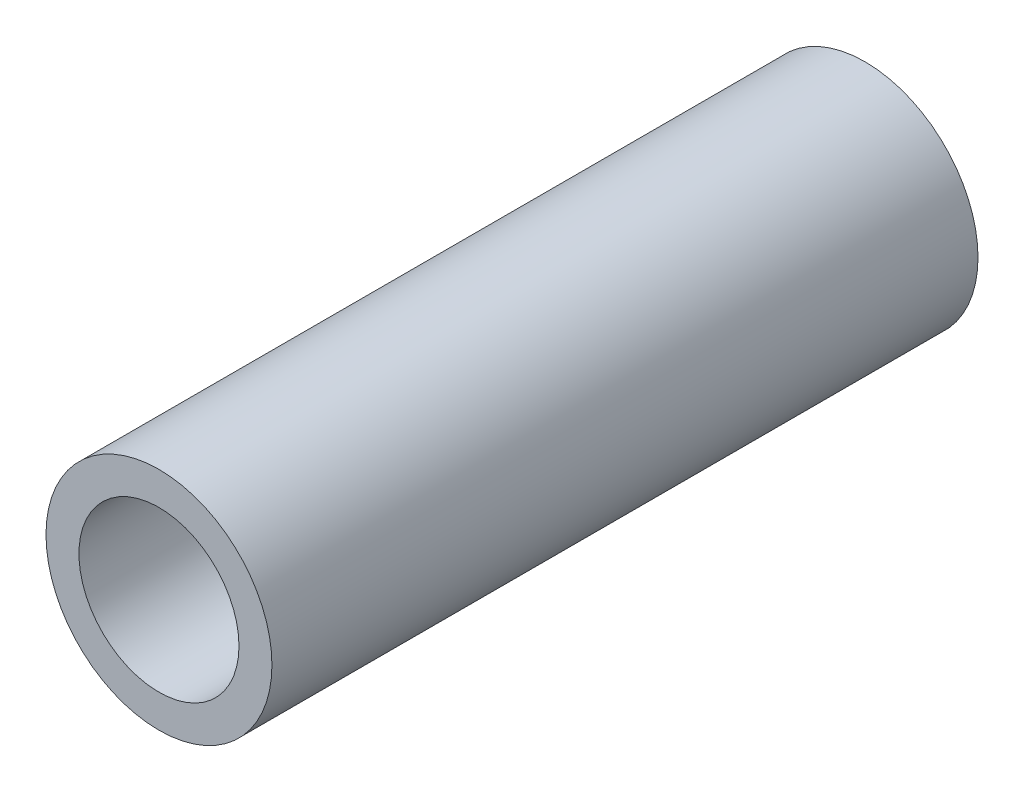
ISO-10303-21;
HEADER;
FILE_DESCRIPTION(('STEP AP214'),'2;1');
FILE_NAME('part.step','',(''),(''),'','','');
FILE_SCHEMA(('AUTOMOTIVE_DESIGN { 1 0 10303 214 1 1 1 1 }'));
ENDSEC;
DATA;
#1=APPLICATION_CONTEXT('core data for automotive mechanical design processes');
#2=APPLICATION_PROTOCOL_DEFINITION('international standard','automotive_design',2000,#1);
#3=PRODUCT_CONTEXT('',#1,'mechanical');
#4=PRODUCT('Part','Part','',(#3));
#5=PRODUCT_RELATED_PRODUCT_CATEGORY('part','',(#4));
#6=PRODUCT_DEFINITION_FORMATION('','',#4);
#7=PRODUCT_DEFINITION_CONTEXT('part definition',#1,'design');
#8=PRODUCT_DEFINITION('design','',#6,#7);
#9=PRODUCT_DEFINITION_SHAPE('','',#8);
#10=(LENGTH_UNIT() NAMED_UNIT(*) SI_UNIT(.MILLI.,.METRE.));
#11=(NAMED_UNIT(*) PLANE_ANGLE_UNIT() SI_UNIT($,.RADIAN.));
#12=(NAMED_UNIT(*) SI_UNIT($,.STERADIAN.) SOLID_ANGLE_UNIT());
#13=UNCERTAINTY_MEASURE_WITH_UNIT(LENGTH_MEASURE(1.E-05),#10,'distance_accuracy_value','');
#14=(GEOMETRIC_REPRESENTATION_CONTEXT(3) GLOBAL_UNCERTAINTY_ASSIGNED_CONTEXT((#13)) GLOBAL_UNIT_ASSIGNED_CONTEXT((#10,
#11,#12)) REPRESENTATION_CONTEXT('',''));
#15=CARTESIAN_POINT('',(0.,0.,0.));
#16=DIRECTION('',(0.,0.,1.));
#17=DIRECTION('',(1.,0.,0.));
#18=AXIS2_PLACEMENT_3D('',#15,#16,#17);
#19=CARTESIAN_POINT('',(0.,0.,37.5));
#20=DIRECTION('',(0.,0.,1.));
#21=DIRECTION('',(1.,0.,0.));
#22=AXIS2_PLACEMENT_3D('',#19,#20,#21);
#23=PLANE('',#22);
#24=CARTESIAN_POINT('',(0.,0.,37.5));
#25=DIRECTION('',(0.,0.,1.));
#26=DIRECTION('',(1.,0.,0.));
#27=AXIS2_PLACEMENT_3D('',#24,#25,#26);
#28=CIRCLE('',#27,12.);
#29=CARTESIAN_POINT('',(12.,0.,37.5));
#30=VERTEX_POINT('',#29);
#31=EDGE_CURVE('E10',#30,#30,#28,.T.);
#32=ORIENTED_EDGE('',*,*,#31,.T.);
#33=EDGE_LOOP('',(#32));
#34=FACE_BOUND('',#33,.T.);
#35=CARTESIAN_POINT('',(0.,0.,37.5));
#36=DIRECTION('',(0.,0.,1.));
#37=DIRECTION('',(1.,0.,0.));
#38=AXIS2_PLACEMENT_3D('',#35,#36,#37);
#39=CIRCLE('',#38,8.5);
#40=CARTESIAN_POINT('',(8.5,0.,37.5));
#41=VERTEX_POINT('',#40);
#42=EDGE_CURVE('E41',#41,#41,#39,.T.);
#43=ORIENTED_EDGE('',*,*,#42,.F.);
#44=EDGE_LOOP('',(#43));
#45=FACE_BOUND('',#44,.T.);
#46=ADVANCED_FACE('F30',(#34,#45),#23,.T.);
#47=CARTESIAN_POINT('',(0.,0.,-37.5));
#48=DIRECTION('',(0.,0.,1.));
#49=DIRECTION('',(1.,0.,0.));
#50=AXIS2_PLACEMENT_3D('',#47,#48,#49);
#51=PLANE('',#50);
#52=CARTESIAN_POINT('',(0.,0.,-37.5));
#53=DIRECTION('',(0.,0.,1.));
#54=DIRECTION('',(1.,0.,0.));
#55=AXIS2_PLACEMENT_3D('',#52,#53,#54);
#56=CIRCLE('',#55,12.);
#57=CARTESIAN_POINT('',(12.,0.,-37.5));
#58=VERTEX_POINT('',#57);
#59=EDGE_CURVE('E34',#58,#58,#56,.T.);
#60=ORIENTED_EDGE('',*,*,#59,.F.);
#61=EDGE_LOOP('',(#60));
#62=FACE_BOUND('',#61,.T.);
#63=CARTESIAN_POINT('',(0.,0.,-37.5));
#64=DIRECTION('',(0.,0.,1.));
#65=DIRECTION('',(1.,0.,0.));
#66=AXIS2_PLACEMENT_3D('',#63,#64,#65);
#67=CIRCLE('',#66,8.5);
#68=CARTESIAN_POINT('',(8.5,0.,-37.5));
#69=VERTEX_POINT('',#68);
#70=EDGE_CURVE('E43',#69,#69,#67,.T.);
#71=ORIENTED_EDGE('',*,*,#70,.T.);
#72=EDGE_LOOP('',(#71));
#73=FACE_BOUND('',#72,.T.);
#74=ADVANCED_FACE('F53',(#62,#73),#51,.F.);
#75=CARTESIAN_POINT('',(0.,0.,37.5));
#76=DIRECTION('',(0.,0.,-1.));
#77=DIRECTION('',(-1.,0.,0.));
#78=AXIS2_PLACEMENT_3D('',#75,#76,#77);
#79=CYLINDRICAL_SURFACE('',#78,12.);
#80=ORIENTED_EDGE('',*,*,#31,.F.);
#81=EDGE_LOOP('',(#80));
#82=FACE_BOUND('',#81,.T.);
#83=ORIENTED_EDGE('',*,*,#59,.T.);
#84=EDGE_LOOP('',(#83));
#85=FACE_BOUND('',#84,.T.);
#86=ADVANCED_FACE('F32',(#82,#85),#79,.T.);
#87=CARTESIAN_POINT('',(0.,0.,37.5));
#88=DIRECTION('',(0.,0.,-1.));
#89=DIRECTION('',(-1.,0.,0.));
#90=AXIS2_PLACEMENT_3D('',#87,#88,#89);
#91=CYLINDRICAL_SURFACE('',#90,8.5);
#92=ORIENTED_EDGE('',*,*,#42,.T.);
#93=EDGE_LOOP('',(#92));
#94=FACE_BOUND('',#93,.T.);
#95=ORIENTED_EDGE('',*,*,#70,.F.);
#96=EDGE_LOOP('',(#95));
#97=FACE_BOUND('',#96,.T.);
#98=ADVANCED_FACE('F49',(#94,#97),#91,.F.);
#99=CLOSED_SHELL('',(#46,#74,#86,#98));
#100=MANIFOLD_SOLID_BREP('B2',#99);
#101=ADVANCED_BREP_SHAPE_REPRESENTATION('',(#18,#100),#14);
#102=SHAPE_DEFINITION_REPRESENTATION(#9,#101);
ENDSEC;
END-ISO-10303-21;
